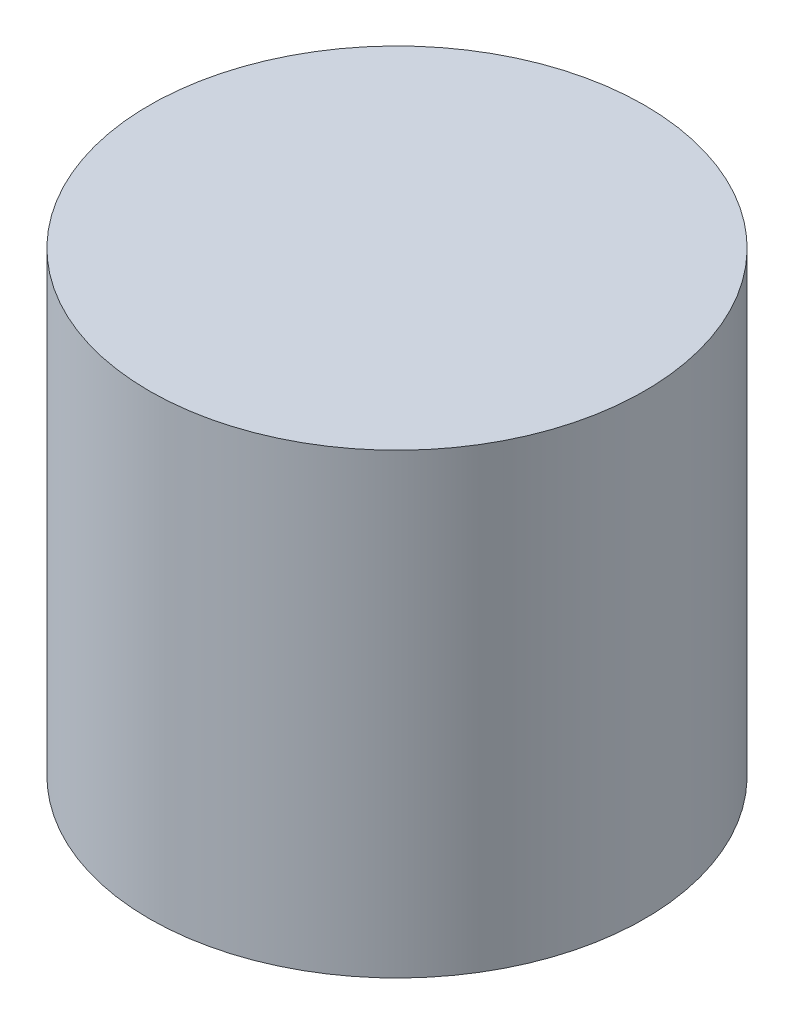
ISO-10303-21;
HEADER;
FILE_DESCRIPTION(('STEP AP214'),'2;1');
FILE_NAME('part.step','',(''),(''),'','','');
FILE_SCHEMA(('AUTOMOTIVE_DESIGN { 1 0 10303 214 1 1 1 1 }'));
ENDSEC;
DATA;
#1=APPLICATION_CONTEXT('core data for automotive mechanical design processes');
#2=APPLICATION_PROTOCOL_DEFINITION('international standard','automotive_design',2000,#1);
#3=PRODUCT_CONTEXT('',#1,'mechanical');
#4=PRODUCT('Part','Part','',(#3));
#5=PRODUCT_RELATED_PRODUCT_CATEGORY('part','',(#4));
#6=PRODUCT_DEFINITION_FORMATION('','',#4);
#7=PRODUCT_DEFINITION_CONTEXT('part definition',#1,'design');
#8=PRODUCT_DEFINITION('design','',#6,#7);
#9=PRODUCT_DEFINITION_SHAPE('','',#8);
#10=(LENGTH_UNIT() NAMED_UNIT(*) SI_UNIT(.MILLI.,.METRE.));
#11=(NAMED_UNIT(*) PLANE_ANGLE_UNIT() SI_UNIT($,.RADIAN.));
#12=(NAMED_UNIT(*) SI_UNIT($,.STERADIAN.) SOLID_ANGLE_UNIT());
#13=UNCERTAINTY_MEASURE_WITH_UNIT(LENGTH_MEASURE(1.E-05),#10,'distance_accuracy_value','');
#14=(GEOMETRIC_REPRESENTATION_CONTEXT(3) GLOBAL_UNCERTAINTY_ASSIGNED_CONTEXT((#13)) GLOBAL_UNIT_ASSIGNED_CONTEXT((#10,
#11,#12)) REPRESENTATION_CONTEXT('',''));
#15=CARTESIAN_POINT('',(0.,0.,0.));
#16=DIRECTION('',(0.,0.,1.));
#17=DIRECTION('',(1.,0.,0.));
#18=AXIS2_PLACEMENT_3D('',#15,#16,#17);
#19=CARTESIAN_POINT('',(0.,0.,0.));
#20=DIRECTION('',(0.,1.,0.));
#21=DIRECTION('',(0.,0.,1.));
#22=AXIS2_PLACEMENT_3D('',#19,#20,#21);
#23=PLANE('',#22);
#24=CARTESIAN_POINT('',(0.,0.,0.));
#25=DIRECTION('',(0.,1.,0.));
#26=DIRECTION('',(0.,0.,1.));
#27=AXIS2_PLACEMENT_3D('',#24,#25,#26);
#28=CIRCLE('',#27,6.858);
#29=CARTESIAN_POINT('',(0.,0.,6.858));
#30=VERTEX_POINT('',#29);
#31=EDGE_CURVE('E44',#30,#30,#28,.T.);
#32=ORIENTED_EDGE('',*,*,#31,.T.);
#33=EDGE_LOOP('',(#32));
#34=FACE_BOUND('',#33,.T.);
#35=CARTESIAN_POINT('',(0.,0.,0.));
#36=DIRECTION('',(0.,1.,0.));
#37=DIRECTION('',(0.,0.,1.));
#38=AXIS2_PLACEMENT_3D('',#35,#36,#37);
#39=CIRCLE('',#38,8.255);
#40=CARTESIAN_POINT('',(0.,0.,8.255));
#41=VERTEX_POINT('',#40);
#42=EDGE_CURVE('E48',#41,#41,#39,.T.);
#43=ORIENTED_EDGE('',*,*,#42,.F.);
#44=EDGE_LOOP('',(#43));
#45=FACE_BOUND('',#44,.T.);
#46=ADVANCED_FACE('F36',(#34,#45),#23,.F.);
#47=CARTESIAN_POINT('',(0.,12.7,0.));
#48=DIRECTION('',(0.,-1.,0.));
#49=DIRECTION('',(0.,0.,-1.));
#50=AXIS2_PLACEMENT_3D('',#47,#48,#49);
#51=CYLINDRICAL_SURFACE('',#50,8.255);
#52=ORIENTED_EDGE('',*,*,#42,.T.);
#53=EDGE_LOOP('',(#52));
#54=FACE_BOUND('',#53,.T.);
#55=CARTESIAN_POINT('',(0.,15.24,0.));
#56=DIRECTION('',(0.,1.,0.));
#57=DIRECTION('',(0.,0.,1.));
#58=AXIS2_PLACEMENT_3D('',#55,#56,#57);
#59=CIRCLE('',#58,8.255);
#60=CARTESIAN_POINT('',(0.,15.24,8.255));
#61=VERTEX_POINT('',#60);
#62=EDGE_CURVE('E57',#61,#61,#59,.T.);
#63=ORIENTED_EDGE('',*,*,#62,.F.);
#64=EDGE_LOOP('',(#63));
#65=FACE_BOUND('',#64,.T.);
#66=ADVANCED_FACE('F63',(#54,#65),#51,.T.);
#67=CARTESIAN_POINT('',(0.,12.7,0.));
#68=DIRECTION('',(0.,-1.,0.));
#69=DIRECTION('',(0.,0.,-1.));
#70=AXIS2_PLACEMENT_3D('',#67,#68,#69);
#71=CYLINDRICAL_SURFACE('',#70,6.35);
#72=CARTESIAN_POINT('',(0.,0.508000000000005,0.));
#73=DIRECTION('',(0.,1.,0.));
#74=DIRECTION('',(0.,0.,1.));
#75=AXIS2_PLACEMENT_3D('',#72,#73,#74);
#76=CIRCLE('',#75,6.35);
#77=CARTESIAN_POINT('',(0.,0.508000000000005,6.35));
#78=VERTEX_POINT('',#77);
#79=EDGE_CURVE('E10',#78,#78,#76,.F.);
#80=ORIENTED_EDGE('',*,*,#79,.T.);
#81=EDGE_LOOP('',(#80));
#82=FACE_BOUND('',#81,.T.);
#83=CARTESIAN_POINT('',(0.,12.7,0.));
#84=DIRECTION('',(0.,1.,0.));
#85=DIRECTION('',(0.,0.,1.));
#86=AXIS2_PLACEMENT_3D('',#83,#84,#85);
#87=CIRCLE('',#86,6.35);
#88=CARTESIAN_POINT('',(0.,12.7,6.35));
#89=VERTEX_POINT('',#88);
#90=EDGE_CURVE('E52',#89,#89,#87,.T.);
#91=ORIENTED_EDGE('',*,*,#90,.T.);
#92=EDGE_LOOP('',(#91));
#93=FACE_BOUND('',#92,.T.);
#94=ADVANCED_FACE('F65',(#82,#93),#71,.F.);
#95=CARTESIAN_POINT('',(0.,12.7,0.));
#96=DIRECTION('',(0.,1.,0.));
#97=DIRECTION('',(0.,0.,1.));
#98=AXIS2_PLACEMENT_3D('',#95,#96,#97);
#99=PLANE('',#98);
#100=ORIENTED_EDGE('',*,*,#90,.F.);
#101=EDGE_LOOP('',(#100));
#102=FACE_BOUND('',#101,.T.);
#103=ADVANCED_FACE('F71',(#102),#99,.F.);
#104=CARTESIAN_POINT('',(0.,15.24,0.));
#105=DIRECTION('',(0.,1.,0.));
#106=DIRECTION('',(0.,0.,1.));
#107=AXIS2_PLACEMENT_3D('',#104,#105,#106);
#108=PLANE('',#107);
#109=ORIENTED_EDGE('',*,*,#62,.T.);
#110=EDGE_LOOP('',(#109));
#111=FACE_BOUND('',#110,.T.);
#112=ADVANCED_FACE('F61',(#111),#108,.T.);
#113=CARTESIAN_POINT('',(0.,0.,0.));
#114=DIRECTION('',(0.,-1.,0.));
#115=DIRECTION('',(0.,0.,-1.));
#116=AXIS2_PLACEMENT_3D('',#113,#114,#115);
#117=CONICAL_SURFACE('',#116,6.858,0.785398163397447);
#118=ORIENTED_EDGE('',*,*,#79,.F.);
#119=EDGE_LOOP('',(#118));
#120=FACE_BOUND('',#119,.T.);
#121=ORIENTED_EDGE('',*,*,#31,.F.);
#122=EDGE_LOOP('',(#121));
#123=FACE_BOUND('',#122,.T.);
#124=ADVANCED_FACE('F39',(#120,#123),#117,.F.);
#125=CLOSED_SHELL('',(#46,#66,#94,#103,#112,#124));
#126=MANIFOLD_SOLID_BREP('B2',#125);
#127=ADVANCED_BREP_SHAPE_REPRESENTATION('',(#18,#126),#14);
#128=SHAPE_DEFINITION_REPRESENTATION(#9,#127);
ENDSEC;
END-ISO-10303-21;
